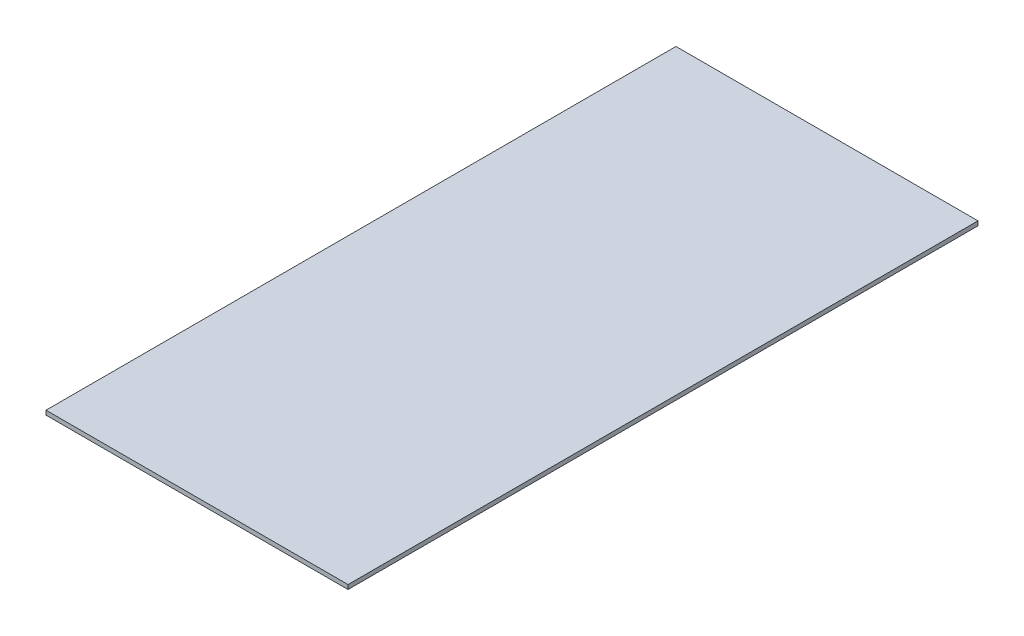
ISO-10303-21;
HEADER;
FILE_DESCRIPTION(('STEP AP214'),'2;1');
FILE_NAME('part.step','',(''),(''),'','','');
FILE_SCHEMA(('AUTOMOTIVE_DESIGN { 1 0 10303 214 1 1 1 1 }'));
ENDSEC;
DATA;
#1=APPLICATION_CONTEXT('core data for automotive mechanical design processes');
#2=APPLICATION_PROTOCOL_DEFINITION('international standard','automotive_design',2000,#1);
#3=PRODUCT_CONTEXT('',#1,'mechanical');
#4=PRODUCT('Part','Part','',(#3));
#5=PRODUCT_RELATED_PRODUCT_CATEGORY('part','',(#4));
#6=PRODUCT_DEFINITION_FORMATION('','',#4);
#7=PRODUCT_DEFINITION_CONTEXT('part definition',#1,'design');
#8=PRODUCT_DEFINITION('design','',#6,#7);
#9=PRODUCT_DEFINITION_SHAPE('','',#8);
#10=(LENGTH_UNIT() NAMED_UNIT(*) SI_UNIT(.MILLI.,.METRE.));
#11=(NAMED_UNIT(*) PLANE_ANGLE_UNIT() SI_UNIT($,.RADIAN.));
#12=(NAMED_UNIT(*) SI_UNIT($,.STERADIAN.) SOLID_ANGLE_UNIT());
#13=UNCERTAINTY_MEASURE_WITH_UNIT(LENGTH_MEASURE(1.E-05),#10,'distance_accuracy_value','');
#14=(GEOMETRIC_REPRESENTATION_CONTEXT(3) GLOBAL_UNCERTAINTY_ASSIGNED_CONTEXT((#13)) GLOBAL_UNIT_ASSIGNED_CONTEXT((#10,
#11,#12)) REPRESENTATION_CONTEXT('',''));
#15=CARTESIAN_POINT('',(0.,0.,0.));
#16=DIRECTION('',(0.,0.,1.));
#17=DIRECTION('',(1.,0.,0.));
#18=AXIS2_PLACEMENT_3D('',#15,#16,#17);
#19=CARTESIAN_POINT('',(-191.956050955414,2.54,-88.6168789808917));
#20=DIRECTION('',(1.,0.,0.));
#21=DIRECTION('',(0.,0.,-1.));
#22=AXIS2_PLACEMENT_3D('',#19,#20,#21);
#23=PLANE('',#22);
#24=DIRECTION('',(0.,0.,1.));
#25=VECTOR('',#24,1.);
#26=CARTESIAN_POINT('',(-191.956050955414,0.,-88.6168789808917));
#27=LINE('',#26,#25);
#28=CARTESIAN_POINT('',(-191.956050955414,0.,-88.6168789808917));
#29=VERTEX_POINT('',#28);
#30=CARTESIAN_POINT('',(-191.956050955414,0.,282.223121019108));
#31=VERTEX_POINT('',#30);
#32=EDGE_CURVE('E95',#29,#31,#27,.T.);
#33=ORIENTED_EDGE('',*,*,#32,.T.);
#34=DIRECTION('',(0.,-1.,0.));
#35=VECTOR('',#34,1.);
#36=CARTESIAN_POINT('',(-191.956050955414,2.54,282.223121019108));
#37=LINE('',#36,#35);
#38=CARTESIAN_POINT('',(-191.956050955414,2.54,282.223121019108));
#39=VERTEX_POINT('',#38);
#40=EDGE_CURVE('E11',#39,#31,#37,.T.);
#41=ORIENTED_EDGE('',*,*,#40,.F.);
#42=DIRECTION('',(0.,0.,1.));
#43=VECTOR('',#42,1.);
#44=CARTESIAN_POINT('',(-191.956050955414,2.54,-88.6168789808917));
#45=LINE('',#44,#43);
#46=CARTESIAN_POINT('',(-191.956050955414,2.54,-88.6168789808917));
#47=VERTEX_POINT('',#46);
#48=EDGE_CURVE('E83',#47,#39,#45,.T.);
#49=ORIENTED_EDGE('',*,*,#48,.F.);
#50=DIRECTION('',(0.,-1.,0.));
#51=VECTOR('',#50,1.);
#52=CARTESIAN_POINT('',(-191.956050955414,2.54,-88.6168789808917));
#53=LINE('',#52,#51);
#54=EDGE_CURVE('E91',#47,#29,#53,.T.);
#55=ORIENTED_EDGE('',*,*,#54,.T.);
#56=EDGE_LOOP('',(#33,#41,#49,#55));
#57=FACE_BOUND('',#56,.T.);
#58=ADVANCED_FACE('F32',(#57),#23,.F.);
#59=CARTESIAN_POINT('',(-191.956050955414,2.54,282.223121019108));
#60=DIRECTION('',(0.,0.,-1.));
#61=DIRECTION('',(-1.,0.,0.));
#62=AXIS2_PLACEMENT_3D('',#59,#60,#61);
#63=PLANE('',#62);
#64=DIRECTION('',(1.,0.,0.));
#65=VECTOR('',#64,1.);
#66=CARTESIAN_POINT('',(-191.956050955414,0.,282.223121019108));
#67=LINE('',#66,#65);
#68=CARTESIAN_POINT('',(-14.1560509554139,0.,282.223121019108));
#69=VERTEX_POINT('',#68);
#70=EDGE_CURVE('E87',#31,#69,#67,.T.);
#71=ORIENTED_EDGE('',*,*,#70,.T.);
#72=DIRECTION('',(0.,-1.,0.));
#73=VECTOR('',#72,1.);
#74=CARTESIAN_POINT('',(-14.1560509554139,2.54,282.223121019108));
#75=LINE('',#74,#73);
#76=CARTESIAN_POINT('',(-14.1560509554139,2.54,282.223121019108));
#77=VERTEX_POINT('',#76);
#78=EDGE_CURVE('E40',#77,#69,#75,.T.);
#79=ORIENTED_EDGE('',*,*,#78,.F.);
#80=DIRECTION('',(1.,0.,0.));
#81=VECTOR('',#80,1.);
#82=CARTESIAN_POINT('',(-191.956050955414,2.54,282.223121019108));
#83=LINE('',#82,#81);
#84=EDGE_CURVE('E78',#39,#77,#83,.T.);
#85=ORIENTED_EDGE('',*,*,#84,.F.);
#86=ORIENTED_EDGE('',*,*,#40,.T.);
#87=EDGE_LOOP('',(#71,#79,#85,#86));
#88=FACE_BOUND('',#87,.T.);
#89=ADVANCED_FACE('F86',(#88),#63,.F.);
#90=CARTESIAN_POINT('',(-14.156050955414,2.54,-88.6168789808917));
#91=DIRECTION('',(-1.,0.,0.));
#92=DIRECTION('',(0.,0.,1.));
#93=AXIS2_PLACEMENT_3D('',#90,#91,#92);
#94=PLANE('',#93);
#95=DIRECTION('',(0.,0.,-1.));
#96=VECTOR('',#95,1.);
#97=CARTESIAN_POINT('',(-14.156050955414,0.,-88.6168789808917));
#98=LINE('',#97,#96);
#99=CARTESIAN_POINT('',(-14.156050955414,0.,-88.6168789808917));
#100=VERTEX_POINT('',#99);
#101=EDGE_CURVE('E65',#69,#100,#98,.T.);
#102=ORIENTED_EDGE('',*,*,#101,.T.);
#103=DIRECTION('',(0.,-1.,0.));
#104=VECTOR('',#103,1.);
#105=CARTESIAN_POINT('',(-14.156050955414,2.54,-88.6168789808917));
#106=LINE('',#105,#104);
#107=CARTESIAN_POINT('',(-14.156050955414,2.54,-88.6168789808917));
#108=VERTEX_POINT('',#107);
#109=EDGE_CURVE('E88',#108,#100,#106,.T.);
#110=ORIENTED_EDGE('',*,*,#109,.F.);
#111=DIRECTION('',(0.,0.,-1.));
#112=VECTOR('',#111,1.);
#113=CARTESIAN_POINT('',(-14.156050955414,2.54,-88.6168789808917));
#114=LINE('',#113,#112);
#115=EDGE_CURVE('E81',#77,#108,#114,.T.);
#116=ORIENTED_EDGE('',*,*,#115,.F.);
#117=ORIENTED_EDGE('',*,*,#78,.T.);
#118=EDGE_LOOP('',(#102,#110,#116,#117));
#119=FACE_BOUND('',#118,.T.);
#120=ADVANCED_FACE('F89',(#119),#94,.F.);
#121=CARTESIAN_POINT('',(-191.956050955414,2.54,-88.6168789808917));
#122=DIRECTION('',(0.,0.,1.));
#123=DIRECTION('',(1.,0.,0.));
#124=AXIS2_PLACEMENT_3D('',#121,#122,#123);
#125=PLANE('',#124);
#126=DIRECTION('',(-1.,0.,0.));
#127=VECTOR('',#126,1.);
#128=CARTESIAN_POINT('',(-191.956050955414,0.,-88.6168789808917));
#129=LINE('',#128,#127);
#130=EDGE_CURVE('E71',#100,#29,#129,.T.);
#131=ORIENTED_EDGE('',*,*,#130,.T.);
#132=ORIENTED_EDGE('',*,*,#54,.F.);
#133=DIRECTION('',(-1.,0.,0.));
#134=VECTOR('',#133,1.);
#135=CARTESIAN_POINT('',(-191.956050955414,2.54,-88.6168789808917));
#136=LINE('',#135,#134);
#137=EDGE_CURVE('E48',#108,#47,#136,.T.);
#138=ORIENTED_EDGE('',*,*,#137,.F.);
#139=ORIENTED_EDGE('',*,*,#109,.T.);
#140=EDGE_LOOP('',(#131,#132,#138,#139));
#141=FACE_BOUND('',#140,.T.);
#142=ADVANCED_FACE('F102',(#141),#125,.F.);
#143=CARTESIAN_POINT('',(0.,2.54,0.));
#144=DIRECTION('',(0.,1.,0.));
#145=DIRECTION('',(0.,0.,1.));
#146=AXIS2_PLACEMENT_3D('',#143,#144,#145);
#147=PLANE('',#146);
#148=ORIENTED_EDGE('',*,*,#48,.T.);
#149=ORIENTED_EDGE('',*,*,#84,.T.);
#150=ORIENTED_EDGE('',*,*,#115,.T.);
#151=ORIENTED_EDGE('',*,*,#137,.T.);
#152=EDGE_LOOP('',(#148,#149,#150,#151));
#153=FACE_BOUND('',#152,.T.);
#154=ADVANCED_FACE('F79',(#153),#147,.T.);
#155=CARTESIAN_POINT('',(0.,0.,0.));
#156=DIRECTION('',(0.,1.,0.));
#157=DIRECTION('',(0.,0.,1.));
#158=AXIS2_PLACEMENT_3D('',#155,#156,#157);
#159=PLANE('',#158);
#160=ORIENTED_EDGE('',*,*,#32,.F.);
#161=ORIENTED_EDGE('',*,*,#130,.F.);
#162=ORIENTED_EDGE('',*,*,#101,.F.);
#163=ORIENTED_EDGE('',*,*,#70,.F.);
#164=EDGE_LOOP('',(#160,#161,#162,#163));
#165=FACE_BOUND('',#164,.T.);
#166=ADVANCED_FACE('F105',(#165),#159,.F.);
#167=CLOSED_SHELL('',(#58,#89,#120,#142,#154,#166));
#168=MANIFOLD_SOLID_BREP('B2',#167);
#169=ADVANCED_BREP_SHAPE_REPRESENTATION('',(#18,#168),#14);
#170=SHAPE_DEFINITION_REPRESENTATION(#9,#169);
ENDSEC;
END-ISO-10303-21;
